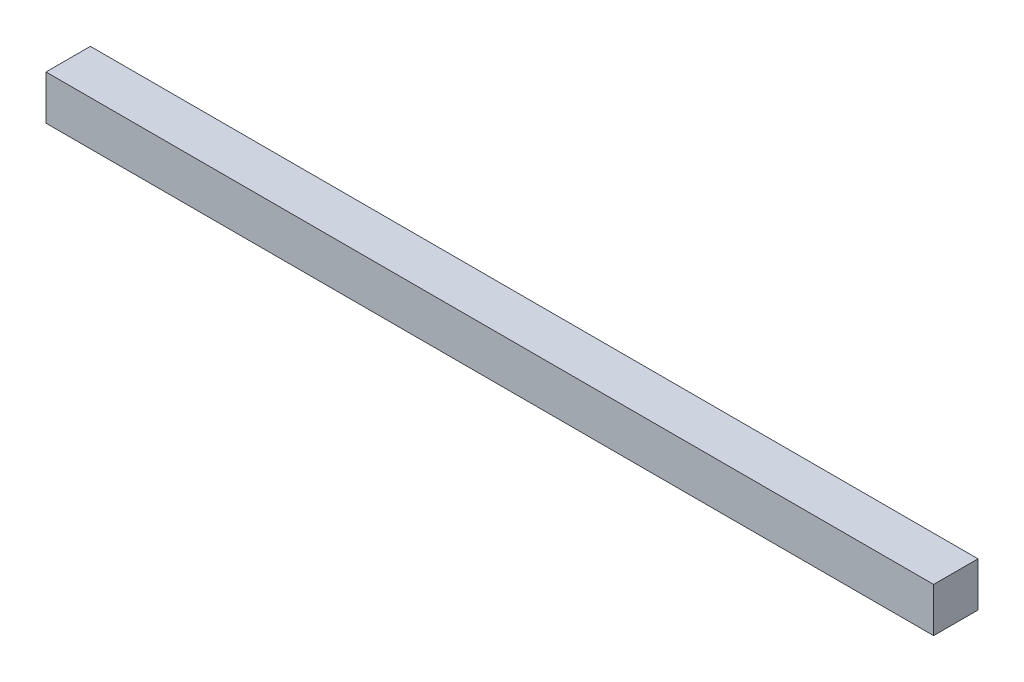
ISO-10303-21;
HEADER;
FILE_DESCRIPTION(('STEP AP214'),'2;1');
FILE_NAME('part.step','',(''),(''),'','','');
FILE_SCHEMA(('AUTOMOTIVE_DESIGN { 1 0 10303 214 1 1 1 1 }'));
ENDSEC;
DATA;
#1=APPLICATION_CONTEXT('core data for automotive mechanical design processes');
#2=APPLICATION_PROTOCOL_DEFINITION('international standard','automotive_design',2000,#1);
#3=PRODUCT_CONTEXT('',#1,'mechanical');
#4=PRODUCT('Part','Part','',(#3));
#5=PRODUCT_RELATED_PRODUCT_CATEGORY('part','',(#4));
#6=PRODUCT_DEFINITION_FORMATION('','',#4);
#7=PRODUCT_DEFINITION_CONTEXT('part definition',#1,'design');
#8=PRODUCT_DEFINITION('design','',#6,#7);
#9=PRODUCT_DEFINITION_SHAPE('','',#8);
#10=(LENGTH_UNIT() NAMED_UNIT(*) SI_UNIT(.MILLI.,.METRE.));
#11=(NAMED_UNIT(*) PLANE_ANGLE_UNIT() SI_UNIT($,.RADIAN.));
#12=(NAMED_UNIT(*) SI_UNIT($,.STERADIAN.) SOLID_ANGLE_UNIT());
#13=UNCERTAINTY_MEASURE_WITH_UNIT(LENGTH_MEASURE(1.E-05),#10,'distance_accuracy_value','');
#14=(GEOMETRIC_REPRESENTATION_CONTEXT(3) GLOBAL_UNCERTAINTY_ASSIGNED_CONTEXT((#13)) GLOBAL_UNIT_ASSIGNED_CONTEXT((#10,
#11,#12)) REPRESENTATION_CONTEXT('',''));
#15=CARTESIAN_POINT('',(0.,0.,0.));
#16=DIRECTION('',(0.,0.,1.));
#17=DIRECTION('',(1.,0.,0.));
#18=AXIS2_PLACEMENT_3D('',#15,#16,#17);
#19=CARTESIAN_POINT('',(0.,0.,10.));
#20=DIRECTION('',(1.,0.,0.));
#21=DIRECTION('',(0.,0.,-1.));
#22=AXIS2_PLACEMENT_3D('',#19,#20,#21);
#23=PLANE('',#22);
#24=DIRECTION('',(0.,-1.,0.));
#25=VECTOR('',#24,1.);
#26=CARTESIAN_POINT('',(0.,0.,0.));
#27=LINE('',#26,#25);
#28=CARTESIAN_POINT('',(0.,10.,0.));
#29=VERTEX_POINT('',#28);
#30=CARTESIAN_POINT('',(0.,0.,0.));
#31=VERTEX_POINT('',#30);
#32=EDGE_CURVE('E107',#29,#31,#27,.T.);
#33=ORIENTED_EDGE('',*,*,#32,.T.);
#34=DIRECTION('',(0.,0.,-1.));
#35=VECTOR('',#34,1.);
#36=CARTESIAN_POINT('',(0.,0.,10.));
#37=LINE('',#36,#35);
#38=CARTESIAN_POINT('',(0.,0.,10.));
#39=VERTEX_POINT('',#38);
#40=EDGE_CURVE('E11',#39,#31,#37,.T.);
#41=ORIENTED_EDGE('',*,*,#40,.F.);
#42=DIRECTION('',(0.,-1.,0.));
#43=VECTOR('',#42,1.);
#44=CARTESIAN_POINT('',(0.,0.,10.));
#45=LINE('',#44,#43);
#46=CARTESIAN_POINT('',(0.,10.,10.));
#47=VERTEX_POINT('',#46);
#48=EDGE_CURVE('E91',#47,#39,#45,.T.);
#49=ORIENTED_EDGE('',*,*,#48,.F.);
#50=DIRECTION('',(0.,0.,-1.));
#51=VECTOR('',#50,1.);
#52=CARTESIAN_POINT('',(0.,10.,10.));
#53=LINE('',#52,#51);
#54=EDGE_CURVE('E103',#47,#29,#53,.T.);
#55=ORIENTED_EDGE('',*,*,#54,.T.);
#56=EDGE_LOOP('',(#33,#41,#49,#55));
#57=FACE_BOUND('',#56,.T.);
#58=ADVANCED_FACE('F39',(#57),#23,.F.);
#59=CARTESIAN_POINT('',(0.,0.,10.));
#60=DIRECTION('',(0.,1.,0.));
#61=DIRECTION('',(0.,0.,1.));
#62=AXIS2_PLACEMENT_3D('',#59,#60,#61);
#63=PLANE('',#62);
#64=DIRECTION('',(1.,0.,0.));
#65=VECTOR('',#64,1.);
#66=CARTESIAN_POINT('',(0.,0.,0.));
#67=LINE('',#66,#65);
#68=CARTESIAN_POINT('',(200.,0.,0.));
#69=VERTEX_POINT('',#68);
#70=EDGE_CURVE('E96',#31,#69,#67,.T.);
#71=ORIENTED_EDGE('',*,*,#70,.T.);
#72=DIRECTION('',(0.,0.,-1.));
#73=VECTOR('',#72,1.);
#74=CARTESIAN_POINT('',(200.,0.,10.));
#75=LINE('',#74,#73);
#76=CARTESIAN_POINT('',(200.,0.,10.));
#77=VERTEX_POINT('',#76);
#78=EDGE_CURVE('E48',#77,#69,#75,.T.);
#79=ORIENTED_EDGE('',*,*,#78,.F.);
#80=DIRECTION('',(1.,0.,0.));
#81=VECTOR('',#80,1.);
#82=CARTESIAN_POINT('',(0.,0.,10.));
#83=LINE('',#82,#81);
#84=EDGE_CURVE('E86',#39,#77,#83,.T.);
#85=ORIENTED_EDGE('',*,*,#84,.F.);
#86=ORIENTED_EDGE('',*,*,#40,.T.);
#87=EDGE_LOOP('',(#71,#79,#85,#86));
#88=FACE_BOUND('',#87,.T.);
#89=ADVANCED_FACE('F95',(#88),#63,.F.);
#90=CARTESIAN_POINT('',(200.,0.,10.));
#91=DIRECTION('',(-1.,0.,0.));
#92=DIRECTION('',(0.,0.,1.));
#93=AXIS2_PLACEMENT_3D('',#90,#91,#92);
#94=PLANE('',#93);
#95=DIRECTION('',(0.,1.,0.));
#96=VECTOR('',#95,1.);
#97=CARTESIAN_POINT('',(200.,0.,0.));
#98=LINE('',#97,#96);
#99=CARTESIAN_POINT('',(200.,10.,0.));
#100=VERTEX_POINT('',#99);
#101=EDGE_CURVE('E73',#69,#100,#98,.T.);
#102=ORIENTED_EDGE('',*,*,#101,.T.);
#103=DIRECTION('',(0.,0.,-1.));
#104=VECTOR('',#103,1.);
#105=CARTESIAN_POINT('',(200.,10.,10.));
#106=LINE('',#105,#104);
#107=CARTESIAN_POINT('',(200.,10.,10.));
#108=VERTEX_POINT('',#107);
#109=EDGE_CURVE('E98',#108,#100,#106,.T.);
#110=ORIENTED_EDGE('',*,*,#109,.F.);
#111=DIRECTION('',(0.,1.,0.));
#112=VECTOR('',#111,1.);
#113=CARTESIAN_POINT('',(200.,0.,10.));
#114=LINE('',#113,#112);
#115=EDGE_CURVE('E89',#77,#108,#114,.T.);
#116=ORIENTED_EDGE('',*,*,#115,.F.);
#117=ORIENTED_EDGE('',*,*,#78,.T.);
#118=EDGE_LOOP('',(#102,#110,#116,#117));
#119=FACE_BOUND('',#118,.T.);
#120=ADVANCED_FACE('F99',(#119),#94,.F.);
#121=CARTESIAN_POINT('',(0.,10.,10.));
#122=DIRECTION('',(0.,-1.,0.));
#123=DIRECTION('',(0.,0.,-1.));
#124=AXIS2_PLACEMENT_3D('',#121,#122,#123);
#125=PLANE('',#124);
#126=DIRECTION('',(-1.,0.,0.));
#127=VECTOR('',#126,1.);
#128=CARTESIAN_POINT('',(0.,10.,0.));
#129=LINE('',#128,#127);
#130=EDGE_CURVE('E79',#100,#29,#129,.T.);
#131=ORIENTED_EDGE('',*,*,#130,.T.);
#132=ORIENTED_EDGE('',*,*,#54,.F.);
#133=DIRECTION('',(-1.,0.,0.));
#134=VECTOR('',#133,1.);
#135=CARTESIAN_POINT('',(0.,10.,10.));
#136=LINE('',#135,#134);
#137=EDGE_CURVE('E56',#108,#47,#136,.T.);
#138=ORIENTED_EDGE('',*,*,#137,.F.);
#139=ORIENTED_EDGE('',*,*,#109,.T.);
#140=EDGE_LOOP('',(#131,#132,#138,#139));
#141=FACE_BOUND('',#140,.T.);
#142=ADVANCED_FACE('F120',(#141),#125,.F.);
#143=CARTESIAN_POINT('',(0.,0.,10.));
#144=DIRECTION('',(0.,0.,-1.));
#145=DIRECTION('',(-1.,0.,0.));
#146=AXIS2_PLACEMENT_3D('',#143,#144,#145);
#147=PLANE('',#146);
#148=ORIENTED_EDGE('',*,*,#48,.T.);
#149=ORIENTED_EDGE('',*,*,#84,.T.);
#150=ORIENTED_EDGE('',*,*,#115,.T.);
#151=ORIENTED_EDGE('',*,*,#137,.T.);
#152=EDGE_LOOP('',(#148,#149,#150,#151));
#153=FACE_BOUND('',#152,.T.);
#154=ADVANCED_FACE('F87',(#153),#147,.F.);
#155=CARTESIAN_POINT('',(0.,0.,0.));
#156=DIRECTION('',(0.,0.,-1.));
#157=DIRECTION('',(-1.,0.,0.));
#158=AXIS2_PLACEMENT_3D('',#155,#156,#157);
#159=PLANE('',#158);
#160=ORIENTED_EDGE('',*,*,#32,.F.);
#161=ORIENTED_EDGE('',*,*,#130,.F.);
#162=ORIENTED_EDGE('',*,*,#101,.F.);
#163=ORIENTED_EDGE('',*,*,#70,.F.);
#164=EDGE_LOOP('',(#160,#161,#162,#163));
#165=FACE_BOUND('',#164,.T.);
#166=ADVANCED_FACE('F123',(#165),#159,.T.);
#167=CLOSED_SHELL('',(#58,#89,#120,#142,#154,#166));
#168=MANIFOLD_SOLID_BREP('B2',#167);
#169=ADVANCED_BREP_SHAPE_REPRESENTATION('',(#18,#168),#14);
#170=SHAPE_DEFINITION_REPRESENTATION(#9,#169);
ENDSEC;
END-ISO-10303-21;
